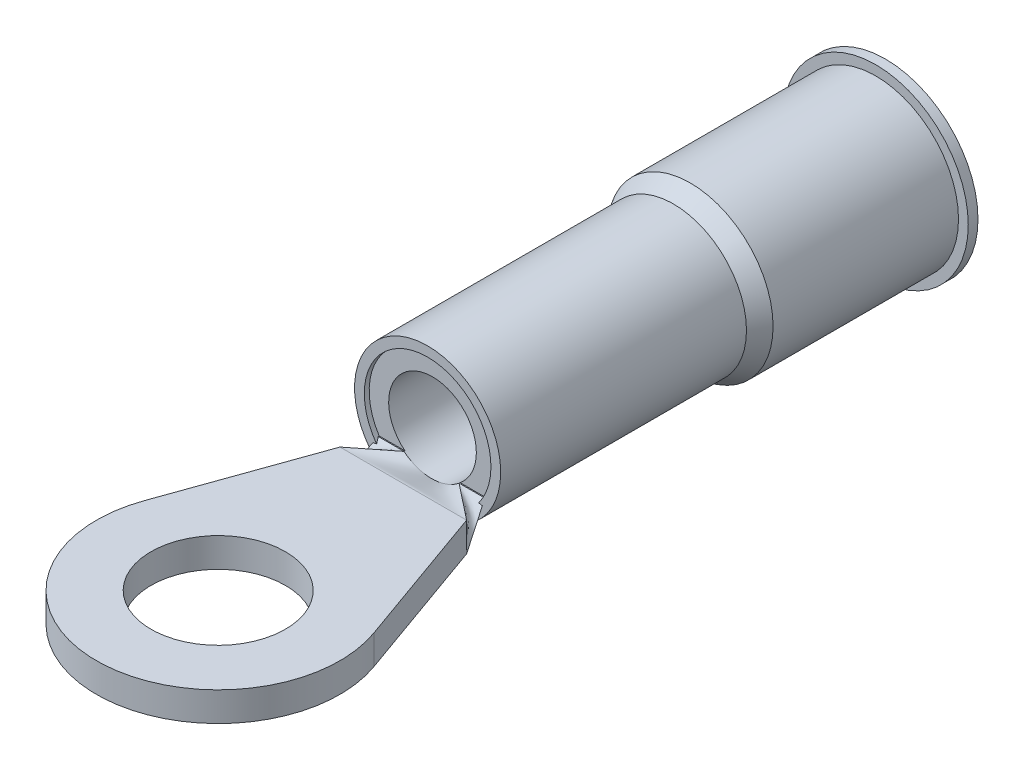
ISO-10303-21;
HEADER;
FILE_DESCRIPTION(('STEP AP214'),'2;1');
FILE_NAME('part.step','',(''),(''),'','','');
FILE_SCHEMA(('AUTOMOTIVE_DESIGN { 1 0 10303 214 1 1 1 1 }'));
ENDSEC;
DATA;
#1=APPLICATION_CONTEXT('core data for automotive mechanical design processes');
#2=APPLICATION_PROTOCOL_DEFINITION('international standard','automotive_design',2000,#1);
#3=PRODUCT_CONTEXT('',#1,'mechanical');
#4=PRODUCT('Part','Part','',(#3));
#5=PRODUCT_RELATED_PRODUCT_CATEGORY('part','',(#4));
#6=PRODUCT_DEFINITION_FORMATION('','',#4);
#7=PRODUCT_DEFINITION_CONTEXT('part definition',#1,'design');
#8=PRODUCT_DEFINITION('design','',#6,#7);
#9=PRODUCT_DEFINITION_SHAPE('','',#8);
#10=(LENGTH_UNIT() NAMED_UNIT(*) SI_UNIT(.MILLI.,.METRE.));
#11=(NAMED_UNIT(*) PLANE_ANGLE_UNIT() SI_UNIT($,.RADIAN.));
#12=(NAMED_UNIT(*) SI_UNIT($,.STERADIAN.) SOLID_ANGLE_UNIT());
#13=UNCERTAINTY_MEASURE_WITH_UNIT(LENGTH_MEASURE(1.E-05),#10,'distance_accuracy_value','');
#14=(GEOMETRIC_REPRESENTATION_CONTEXT(3) GLOBAL_UNCERTAINTY_ASSIGNED_CONTEXT((#13)) GLOBAL_UNIT_ASSIGNED_CONTEXT((#10,
#11,#12)) REPRESENTATION_CONTEXT('',''));
#15=CARTESIAN_POINT('',(0.,0.,0.));
#16=DIRECTION('',(0.,0.,1.));
#17=DIRECTION('',(1.,0.,0.));
#18=AXIS2_PLACEMENT_3D('',#15,#16,#17);
#19=CARTESIAN_POINT('',(-1.39121529606312,0.762,0.0254));
#20=CARTESIAN_POINT('',(-1.47781019737541,0.508,0.270933333333333));
#21=CARTESIAN_POINT('',(-1.56440509868771,0.254,0.516466666666667));
#22=CARTESIAN_POINT('',(-1.651,0.,0.762));
#23=CARTESIAN_POINT('',(-1.23955403655532,0.524662020194092,0.0254));
#24=CARTESIAN_POINT('',(-1.28498046881466,0.349774680129394,0.270933333333333));
#25=CARTESIAN_POINT('',(-1.330406901074,0.174887340064697,0.516466666666667));
#26=CARTESIAN_POINT('',(-1.37583333333333,0.,0.762));
#27=CARTESIAN_POINT('',(-0.83014051960649,0.143662020194092,0.0254));
#28=CARTESIAN_POINT('',(-0.82859367973766,0.0957746801293947,0.270933333333334));
#29=CARTESIAN_POINT('',(-0.82704683986883,0.0478873400646973,0.516466666666667));
#30=CARTESIAN_POINT('',(-0.8255,0.,0.762000000000001));
#31=CARTESIAN_POINT('',(0.,-0.0718310100970455,0.0254));
#32=CARTESIAN_POINT('',(0.,-0.047887340064697,0.270933333333333));
#33=CARTESIAN_POINT('',(0.,-0.0239436700323485,0.516466666666666));
#34=CARTESIAN_POINT('',(0.,0.,0.761999999999999));
#35=CARTESIAN_POINT('',(0.830140519606489,0.143662020194092,0.0254));
#36=CARTESIAN_POINT('',(0.828593679737659,0.0957746801293948,0.270933333333334));
#37=CARTESIAN_POINT('',(0.82704683986883,0.0478873400646974,0.516466666666667));
#38=CARTESIAN_POINT('',(0.8255,0.,0.762000000000001));
#39=CARTESIAN_POINT('',(1.23955403655532,0.524662020194091,0.0254));
#40=CARTESIAN_POINT('',(1.28498046881466,0.349774680129394,0.270933333333333));
#41=CARTESIAN_POINT('',(1.33040690107399,0.174887340064697,0.516466666666667));
#42=CARTESIAN_POINT('',(1.37583333333333,0.,0.762));
#43=CARTESIAN_POINT('',(1.39121529606312,0.761999999999999,0.0254));
#44=CARTESIAN_POINT('',(1.47781019737541,0.507999999999999,0.270933333333333));
#45=CARTESIAN_POINT('',(1.56440509868771,0.254,0.516466666666667));
#46=CARTESIAN_POINT('',(1.651,0.,0.762));
#47=B_SPLINE_SURFACE_WITH_KNOTS('',3,3,((#19,#20,#21,#22),(#23,#24,#25,#26),(#27,#28,#29,#30),
(#31,#32,#33,#34),(#35,#36,#37,#38),(#39,#40,#41,#42),(#43,#44,#45,#46)),.UNSPECIFIED.,.F.,.F.,
.F.,(4,1,1,1,4),(4,4),(0.,0.25,0.5,0.75,1.),(0.,1.),.UNSPECIFIED.);
#48=DIRECTION('',(0.238073071200388,0.698315480109153,-0.675038297438848));
#49=VECTOR('',#48,1.);
#50=CARTESIAN_POINT('',(-1.52110764803156,0.381,0.3937));
#51=LINE('',#50,#49);
#52=CARTESIAN_POINT('',(-1.651,0.,0.762));
#53=VERTEX_POINT('',#52);
#54=CARTESIAN_POINT('',(-1.42704766901993,0.656896551724138,0.127));
#55=VERTEX_POINT('',#54);
#56=EDGE_CURVE('E432',#53,#55,#51,.T.);
#57=CARTESIAN_POINT('',(-1.42704766901993,0.656896551724138,0.127));
#58=CARTESIAN_POINT('',(-1.39758191727476,0.621156019971046,0.127));
#59=CARTESIAN_POINT('',(-1.36669044147473,0.586618245457012,0.127));
#60=CARTESIAN_POINT('',(-1.30226329544282,0.520120364949861,0.127));
#61=CARTESIAN_POINT('',(-1.26872829772447,0.488159607520618,0.127));
#62=CARTESIAN_POINT('',(-1.16467924988584,0.396580652700039,0.127));
#63=CARTESIAN_POINT('',(-1.09052003773562,0.341023025084146,0.127));
#64=CARTESIAN_POINT('',(-0.929285470756384,0.238650935944051,0.127));
#65=CARTESIAN_POINT('',(-0.841675094746148,0.192685818214404,0.127));
#66=CARTESIAN_POINT('',(-0.66019061468465,0.115126560731954,0.127));
#67=CARTESIAN_POINT('',(-0.566309895673391,0.0835478816903494,0.127));
#68=CARTESIAN_POINT('',(-0.419844299965997,0.046371900769037,0.127));
#69=CARTESIAN_POINT('',(-0.368524098851723,0.0355340390327336,0.127));
#70=CARTESIAN_POINT('',(-0.265161649147126,0.0180561265052614,0.127));
#71=CARTESIAN_POINT('',(-0.213119427639096,0.0114159186968148,0.127));
#72=CARTESIAN_POINT('',(-0.108673566363522,0.00244437797419004,0.127));
#73=CARTESIAN_POINT('',(-0.0562699914721443,0.000112290822558793,0.127));
#74=CARTESIAN_POINT('',(0.0485457382792517,-0.000104238741521693,0.127));
#75=CARTESIAN_POINT('',(0.100957893091223,0.00201129473777937,0.127));
#76=CARTESIAN_POINT('',(0.206524326884028,0.0106467655091575,0.127));
#77=CARTESIAN_POINT('',(0.259671166651413,0.0172579957355603,0.127));
#78=CARTESIAN_POINT('',(0.36522394835596,0.0348561880133288,0.127));
#79=CARTESIAN_POINT('',(0.417629799086765,0.0458436839551839,0.127));
#80=CARTESIAN_POINT('',(0.573297522248406,0.0852546919277909,0.127));
#81=CARTESIAN_POINT('',(0.675022386288336,0.120127802259419,0.127));
#82=CARTESIAN_POINT('',(0.871986667874733,0.20731871631408,0.127));
#83=CARTESIAN_POINT('',(0.967144592048948,0.259820057509265,0.127));
#84=CARTESIAN_POINT('',(1.14626155002175,0.381128771582777,0.127));
#85=CARTESIAN_POINT('',(1.23024869613362,0.449893953605291,0.127));
#86=CARTESIAN_POINT('',(1.3281697677111,0.546529322523483,0.127));
#87=CARTESIAN_POINT('',(1.34874781009383,0.567905132476543,0.127));
#88=CARTESIAN_POINT('',(1.38875775940492,0.611655903662194,0.127));
#89=CARTESIAN_POINT('',(1.40819103259336,0.634029615454349,0.127));
#90=CARTESIAN_POINT('',(1.42704766901993,0.656896551724137,0.127));
#91=B_SPLINE_CURVE_WITH_KNOTS('',3,(#57,#58,#59,#60,#61,#62,#63,#64,#65,#66,#67,#68,#69,#70,#71,
#72,#73,#74,#75,#76,#77,#78,#79,#80,#81,#82,#83,#84,#85,#86,#87,#88,#89,#90),.UNSPECIFIED.,.F.,
.F.,(4,2,2,2,2,2,2,2,2,2,2,2,2,2,2,2,4),(0.,0.138884387927252,0.277733556910216,
0.554496905000208,0.850044656744678,1.14590928062392,1.30312528168604,1.46033540158456,
1.61751799555905,1.77469973753025,1.93517258639134,2.09566501842866,2.41661173840474,
2.74100934772726,3.06457447663388,3.15356286656676,3.24244280408155),.UNSPECIFIED.);
#92=CARTESIAN_POINT('',(1.42704766901993,0.656896551724138,0.127));
#93=VERTEX_POINT('',#92);
#94=EDGE_CURVE('E184',#55,#93,#91,.T.);
#95=DIRECTION('',(0.238073071200388,-0.698315480109153,0.675038297438848));
#96=VECTOR('',#95,1.);
#97=CARTESIAN_POINT('',(1.52110764803156,0.381,0.3937));
#98=LINE('',#97,#96);
#99=CARTESIAN_POINT('',(1.651,0.,0.762));
#100=VERTEX_POINT('',#99);
#101=EDGE_CURVE('E430',#93,#100,#98,.T.);
#102=DIRECTION('',(1.,0.,0.));
#103=VECTOR('',#102,1.);
#104=CARTESIAN_POINT('',(0.,0.,0.762));
#105=LINE('',#104,#103);
#106=EDGE_CURVE('E405',#100,#53,#105,.F.);
#107=ORIENTED_EDGE('',*,*,#56,.T.);
#108=ORIENTED_EDGE('',*,*,#94,.T.);
#109=ORIENTED_EDGE('',*,*,#101,.T.);
#110=ORIENTED_EDGE('',*,*,#106,.T.);
#111=EDGE_LOOP('',(#107,#108,#109,#110));
#112=FACE_BOUND('',#111,.T.);
#113=ADVANCED_FACE('F78',(#112),#47,.T.);
#114=CARTESIAN_POINT('',(-0.718420489685532,0.761999999999999,0.0254));
#115=CARTESIAN_POINT('',(-1.02928032645702,0.762,0.270933333333333));
#116=CARTESIAN_POINT('',(-1.34014016322851,0.762,0.516466666666667));
#117=CARTESIAN_POINT('',(-1.651,0.762,0.762));
#118=CARTESIAN_POINT('',(-0.774486723550331,0.761999999999999,0.0254));
#119=CARTESIAN_POINT('',(-1.06665781570022,0.740833333333333,0.270933333333333));
#120=CARTESIAN_POINT('',(-1.35882890785011,0.719666666666666,0.516466666666667));
#121=CARTESIAN_POINT('',(-1.651,0.6985,0.762));
#122=CARTESIAN_POINT('',(-0.88661919127993,0.761999999999999,0.0254));
#123=CARTESIAN_POINT('',(-1.14141279418662,0.6985,0.270933333333333));
#124=CARTESIAN_POINT('',(-1.39620639709331,0.635,0.516466666666666));
#125=CARTESIAN_POINT('',(-1.651,0.5715,0.762));
#126=CARTESIAN_POINT('',(-1.05481789287433,0.762,0.0254));
#127=CARTESIAN_POINT('',(-1.25354526191622,0.635,0.270933333333334));
#128=CARTESIAN_POINT('',(-1.45227263095811,0.508,0.516466666666668));
#129=CARTESIAN_POINT('',(-1.651,0.381,0.762000000000001));
#130=CARTESIAN_POINT('',(-1.22301659446872,0.761999999999999,0.0254));
#131=CARTESIAN_POINT('',(-1.36567772964582,0.5715,0.270933333333333));
#132=CARTESIAN_POINT('',(-1.50833886482291,0.381,0.516466666666666));
#133=CARTESIAN_POINT('',(-1.651,0.1905,0.761999999999999));
#134=CARTESIAN_POINT('',(-1.33514906219832,0.761999999999999,0.0254));
#135=CARTESIAN_POINT('',(-1.44043270813221,0.529166666666666,0.270933333333333));
#136=CARTESIAN_POINT('',(-1.54571635406611,0.296333333333333,0.516466666666667));
#137=CARTESIAN_POINT('',(-1.651,0.0635000000000003,0.762));
#138=CARTESIAN_POINT('',(-1.39121529606312,0.761999999999999,0.0254));
#139=CARTESIAN_POINT('',(-1.47781019737541,0.508,0.270933333333333));
#140=CARTESIAN_POINT('',(-1.56440509868771,0.254,0.516466666666667));
#141=CARTESIAN_POINT('',(-1.651,0.,0.762));
#142=B_SPLINE_SURFACE_WITH_KNOTS('',3,3,((#114,#115,#116,#117),(#118,#119,#120,#121),(#122,#123,
#124,#125),(#126,#127,#128,#129),(#130,#131,#132,#133),(#134,#135,#136,#137),(#138,#139,#140,
#141)),.UNSPECIFIED.,.F.,.F.,.F.,(4,1,1,1,4),(4,4),(0.809457468958157,0.857093101718618,
0.904728734479079,0.952364367239539,1.),(0.,1.),.UNSPECIFIED.);
#143=CARTESIAN_POINT('',(-1.39121529606312,0.762,0.0253999999999994));
#144=CARTESIAN_POINT('',(-1.38608855288108,0.753975647520577,0.0331610564142781));
#145=CARTESIAN_POINT('',(-1.38094789781283,0.746085406524645,0.0410563370567257));
#146=CARTESIAN_POINT('',(-1.3707085552637,0.730650018927489,0.0571622428158725));
#147=CARTESIAN_POINT('',(-1.36560980035942,0.723104151700813,0.0653721364053272));
#148=CARTESIAN_POINT('',(-1.3554998256097,0.708396876537606,0.0821896660357152));
#149=CARTESIAN_POINT('',(-1.35048862622041,0.701235557656195,0.0907973933569945));
#150=CARTESIAN_POINT('',(-1.34063818539088,0.687379878571269,0.108509285916107));
#151=CARTESIAN_POINT('',(-1.33579934700954,0.680686581615087,0.117614502831048));
#152=CARTESIAN_POINT('',(-1.33109964648684,0.674283699776335,0.126999999999995));
#153=B_SPLINE_CURVE_WITH_KNOTS('',3,(#143,#144,#145,#146,#147,#148,#149,#150,#151,#152),
.UNSPECIFIED.,.F.,.F.,(4,2,2,2,4),(0.,0.0368561073399838,0.0736311779630064,0.110414728684775,
0.147279297482322),.UNSPECIFIED.);
#154=CARTESIAN_POINT('',(-1.39121529606312,0.762,0.0254000000000001));
#155=VERTEX_POINT('',#154);
#156=CARTESIAN_POINT('',(-1.33109964648684,0.674283699776336,0.127));
#157=VERTEX_POINT('',#156);
#158=EDGE_CURVE('E174',#155,#157,#153,.T.);
#159=CARTESIAN_POINT('',(-0.847052146280631,0.761999999999999,0.127));
#160=CARTESIAN_POINT('',(-0.89873164530666,0.75263493882306,0.127));
#161=CARTESIAN_POINT('',(-0.950411144332689,0.74326987764612,0.127));
#162=CARTESIAN_POINT('',(-1.05377014238475,0.724539755292241,0.127));
#163=CARTESIAN_POINT('',(-1.10544964141078,0.715174694115301,0.127));
#164=CARTESIAN_POINT('',(-1.24710198329785,0.68950527253362,0.127));
#165=CARTESIAN_POINT('',(-1.33707482615889,0.673200912128879,0.127));
#166=CARTESIAN_POINT('',(-1.42704766901993,0.656896551724137,0.127));
#167=B_SPLINE_CURVE_WITH_KNOTS('',3,(#159,#160,#161,#162,#163,#164,#165,#166),.UNSPECIFIED.,.F.,
.F.,(4,2,2,4),(0.,0.157563558330797,0.315127116661593,0.589441719966538),.UNSPECIFIED.);
#168=EDGE_CURVE('E308',#157,#55,#167,.T.);
#169=DIRECTION('',(0.,1.,0.));
#170=VECTOR('',#169,1.);
#171=CARTESIAN_POINT('',(-1.651,0.762,0.762));
#172=LINE('',#171,#170);
#173=CARTESIAN_POINT('',(-1.651,0.762,0.761999999999999));
#174=VERTEX_POINT('',#173);
#175=EDGE_CURVE('E418',#174,#53,#172,.F.);
#176=DIRECTION('',(-0.784738272337792,0.,0.619827269429393));
#177=VECTOR('',#176,1.);
#178=CARTESIAN_POINT('',(-1.18471024484277,0.762,0.3937));
#179=LINE('',#178,#177);
#180=CARTESIAN_POINT('',(-0.718420489685532,0.762,0.0254));
#181=VERTEX_POINT('',#180);
#182=EDGE_CURVE('E204',#181,#174,#179,.T.);
#183=DIRECTION('',(-1.,0.,0.));
#184=VECTOR('',#183,1.);
#185=CARTESIAN_POINT('',(-0.718420489685532,0.761999999999999,0.0254));
#186=LINE('',#185,#184);
#187=EDGE_CURVE('E192',#181,#155,#186,.T.);
#188=ORIENTED_EDGE('',*,*,#158,.T.);
#189=ORIENTED_EDGE('',*,*,#168,.T.);
#190=ORIENTED_EDGE('',*,*,#56,.F.);
#191=ORIENTED_EDGE('',*,*,#175,.F.);
#192=ORIENTED_EDGE('',*,*,#182,.F.);
#193=ORIENTED_EDGE('',*,*,#187,.T.);
#194=EDGE_LOOP('',(#188,#189,#190,#191,#192,#193));
#195=FACE_BOUND('',#194,.T.);
#196=ADVANCED_FACE('F201',(#195),#142,.T.);
#197=CARTESIAN_POINT('',(0.718420489685532,0.761999999999999,0.0254));
#198=CARTESIAN_POINT('',(1.02928032645702,0.762,0.270933333333333));
#199=CARTESIAN_POINT('',(1.34014016322851,0.762,0.516466666666667));
#200=CARTESIAN_POINT('',(1.651,0.762,0.762));
#201=CARTESIAN_POINT('',(0.617715486250442,0.680618067624724,0.0254));
#202=CARTESIAN_POINT('',(0.870421435278072,0.707745378416483,0.270933333333333));
#203=CARTESIAN_POINT('',(1.1231273843057,0.734872689208241,0.516466666666667));
#204=CARTESIAN_POINT('',(1.37583333333333,0.762,0.762));
#205=CARTESIAN_POINT('',(0.388426025516563,0.552394071071588,0.0254000000000001));
#206=CARTESIAN_POINT('',(0.534117350344376,0.622262714047725,0.270933333333333));
#207=CARTESIAN_POINT('',(0.679808675172188,0.692131357023863,0.516466666666667));
#208=CARTESIAN_POINT('',(0.825500000000001,0.762,0.762));
#209=CARTESIAN_POINT('',(0.,0.485773897218784,0.0254));
#210=CARTESIAN_POINT('',(0.,0.577849264812523,0.270933333333333));
#211=CARTESIAN_POINT('',(0.,0.669924632406261,0.516466666666667));
#212=CARTESIAN_POINT('',(0.,0.762,0.762));
#213=CARTESIAN_POINT('',(-0.388426025516564,0.552394071071588,0.0254));
#214=CARTESIAN_POINT('',(-0.534117350344376,0.622262714047725,0.270933333333333));
#215=CARTESIAN_POINT('',(-0.679808675172188,0.692131357023863,0.516466666666667));
#216=CARTESIAN_POINT('',(-0.8255,0.762,0.762));
#217=CARTESIAN_POINT('',(-0.617715486250443,0.680618067624724,0.0254));
#218=CARTESIAN_POINT('',(-0.870421435278073,0.707745378416483,0.270933333333333));
#219=CARTESIAN_POINT('',(-1.1231273843057,0.734872689208241,0.516466666666667));
#220=CARTESIAN_POINT('',(-1.37583333333333,0.762,0.762));
#221=CARTESIAN_POINT('',(-0.718420489685532,0.761999999999999,0.0254));
#222=CARTESIAN_POINT('',(-1.02928032645702,0.762,0.270933333333333));
#223=CARTESIAN_POINT('',(-1.34014016322851,0.762,0.516466666666667));
#224=CARTESIAN_POINT('',(-1.651,0.762,0.762));
#225=B_SPLINE_SURFACE_WITH_KNOTS('',3,3,((#197,#198,#199,#200),(#201,#202,#203,#204),(#205,#206,
#207,#208),(#209,#210,#211,#212),(#213,#214,#215,#216),(#217,#218,#219,#220),(#221,#222,#223,
#224)),.UNSPECIFIED.,.F.,.F.,.F.,(4,1,1,1,4),(4,4),(0.190542531041843,0.345271265520921,0.5,
0.654728734479079,0.809457468958157),(0.,1.),.UNSPECIFIED.);
#226=CARTESIAN_POINT('',(0.,1.651,0.0254));
#227=DIRECTION('',(0.,0.,-1.));
#228=DIRECTION('',(1.,0.,0.));
#229=AXIS2_PLACEMENT_3D('',#226,#227,#228);
#230=CIRCLE('',#229,1.143);
#231=CARTESIAN_POINT('',(0.718420489685532,0.761999999999999,0.0254));
#232=VERTEX_POINT('',#231);
#233=CARTESIAN_POINT('',(0.280093594641271,0.542819573389863,0.0254));
#234=VERTEX_POINT('',#233);
#235=EDGE_CURVE('E206',#232,#234,#230,.T.);
#236=CARTESIAN_POINT('',(0.280086317799953,0.542848090476192,0.0254));
#237=CARTESIAN_POINT('',(0.274435453146551,0.541419829924682,0.0253898757300014));
#238=CARTESIAN_POINT('',(0.268773634953075,0.540034876181237,0.0253815517042047));
#239=CARTESIAN_POINT('',(0.256810333648759,0.537205395040891,0.025367029172351));
#240=CARTESIAN_POINT('',(0.250506484126485,0.535770865005437,0.0253611618348143));
#241=CARTESIAN_POINT('',(0.237253661374286,0.532873047210581,0.0253515275315568));
#242=CARTESIAN_POINT('',(0.23030226611733,0.531420828445981,0.0253480241666326));
#243=CARTESIAN_POINT('',(0.215749315169803,0.528521761640067,0.0253431953071069));
#244=CARTESIAN_POINT('',(0.208145337102078,0.527087064644947,0.0253420931933865));
#245=CARTESIAN_POINT('',(0.192282898443226,0.52426052919858,0.0253420952879215));
#246=CARTESIAN_POINT('',(0.184022076020688,0.522881934751302,0.0253433885339403));
#247=CARTESIAN_POINT('',(0.166842658096937,0.520208501393833,0.0253482149334854));
#248=CARTESIAN_POINT('',(0.157921827716278,0.518928010945526,0.0253519109914221));
#249=CARTESIAN_POINT('',(0.139420476007071,0.516495147330165,0.025361559850228));
#250=CARTESIAN_POINT('',(0.129837918764648,0.515358239536721,0.0253676537671633));
#251=CARTESIAN_POINT('',(0.110012945822629,0.513260419584125,0.025382142066703));
#252=CARTESIAN_POINT('',(0.0997687718967419,0.512316102862729,0.0253906618603731));
#253=CARTESIAN_POINT('',(0.0895136704791261,0.511510507816197,0.0254));
#254=B_SPLINE_CURVE_WITH_KNOTS('',3,(#236,#237,#238,#239,#240,#241,#242,#243,#244,#245,#246,
#247,#248,#249,#250,#251,#252,#253),.UNSPECIFIED.,.F.,.F.,(4,2,2,2,2,2,2,2,4),(0.,
0.0174855734570703,0.0368796879760257,0.0581828587489586,0.0813956904950005,0.10651886566124,
0.133553138647615,0.162499343526083,0.193358425668611),.UNSPECIFIED.);
#255=CARTESIAN_POINT('',(0.089516606997273,0.511472074409526,0.0254));
#256=VERTEX_POINT('',#255);
#257=EDGE_CURVE('E13',#234,#256,#254,.T.);
#258=CARTESIAN_POINT('',(0.718420489685532,0.761999999999999,0.0254));
#259=CARTESIAN_POINT('',(0.617715486250442,0.680618067624724,0.0254));
#260=CARTESIAN_POINT('',(0.388426025516563,0.552394071071588,0.0254000000000001));
#261=CARTESIAN_POINT('',(0.,0.485773897218784,0.0254));
#262=CARTESIAN_POINT('',(-0.388426025516564,0.552394071071588,0.0254));
#263=CARTESIAN_POINT('',(-0.617715486250443,0.680618067624724,0.0254));
#264=CARTESIAN_POINT('',(-0.718420489685532,0.761999999999999,0.0254));
#265=B_SPLINE_CURVE_WITH_KNOTS('',3,(#258,#259,#260,#261,#262,#263,#264),.UNSPECIFIED.,.F.,.F.,
(4,1,1,1,4),(0.190542531041843,0.345271265520921,0.5,0.654728734479079,0.809457468958157),.UNSPECIFIED.);
#266=CARTESIAN_POINT('',(-0.0895153171618941,0.51148892797954,0.0254));
#267=VERTEX_POINT('',#266);
#268=EDGE_CURVE('E197',#256,#267,#265,.T.);
#269=CARTESIAN_POINT('',(-0.0895136706448394,0.511510507829265,0.0254));
#270=CARTESIAN_POINT('',(-0.0997687720410653,0.512316102875615,0.0253906618603894));
#271=CARTESIAN_POINT('',(-0.110012945945588,0.513260419596252,0.0253821420667349));
#272=CARTESIAN_POINT('',(-0.1298379188475,0.515358239546391,0.0253676537672216));
#273=CARTESIAN_POINT('',(-0.139420476071171,0.516495147338236,0.0253615598502975));
#274=CARTESIAN_POINT('',(-0.157921827745502,0.518928010949762,0.025351910991509));
#275=CARTESIAN_POINT('',(-0.166842658110025,0.520208501395922,0.0253482149335793));
#276=CARTESIAN_POINT('',(-0.184022076004126,0.52288193474873,0.0253433885340428));
#277=CARTESIAN_POINT('',(-0.192282898413135,0.524260529193574,0.0253420952880267));
#278=CARTESIAN_POINT('',(-0.208145337047529,0.527087064634951,0.0253420931934917));
#279=CARTESIAN_POINT('',(-0.215749315104312,0.528521761627587,0.0253431953072103));
#280=CARTESIAN_POINT('',(-0.230302266032525,0.531420828428625,0.0253480241667272));
#281=CARTESIAN_POINT('',(-0.237253661281096,0.532873047190899,0.0253515275316453));
#282=CARTESIAN_POINT('',(-0.250506484019064,0.535770864981382,0.0253611618348855));
#283=CARTESIAN_POINT('',(-0.256810333535479,0.537205395014848,0.0253670291724122));
#284=CARTESIAN_POINT('',(-0.268773634830581,0.540034876151665,0.0253815517042392));
#285=CARTESIAN_POINT('',(-0.27443545302069,0.541419829893615,0.0253898757300211));
#286=CARTESIAN_POINT('',(-0.280086317670744,0.542848090443578,0.0254));
#287=B_SPLINE_CURVE_WITH_KNOTS('',3,(#269,#270,#271,#272,#273,#274,#275,#276,#277,#278,#279,
#280,#281,#282,#283,#284,#285,#286),.UNSPECIFIED.,.F.,.F.,(4,2,2,2,2,2,2,2,4),(0.,
0.0308590820785189,0.0598052869005761,0.0868395598381356,0.111962734963151,0.135175566675559,
0.156478737422446,0.175872851922941,0.193358425369136),.UNSPECIFIED.);
#288=CARTESIAN_POINT('',(-0.280097541124282,0.542804046174763,0.0254));
#289=VERTEX_POINT('',#288);
#290=EDGE_CURVE('E89',#267,#289,#287,.T.);
#291=CARTESIAN_POINT('',(0.718420489685532,0.761999999999999,0.0254));
#292=CARTESIAN_POINT('',(0.617715486250442,0.680618067624724,0.0254));
#293=CARTESIAN_POINT('',(0.388426025516563,0.552394071071588,0.0254000000000001));
#294=CARTESIAN_POINT('',(0.,0.485773897218784,0.0254));
#295=CARTESIAN_POINT('',(-0.388426025516564,0.552394071071588,0.0254));
#296=CARTESIAN_POINT('',(-0.617715486250443,0.680618067624724,0.0254));
#297=CARTESIAN_POINT('',(-0.718420489685532,0.761999999999999,0.0254));
#298=B_SPLINE_CURVE_WITH_KNOTS('',3,(#291,#292,#293,#294,#295,#296,#297),.UNSPECIFIED.,.F.,.F.,
(4,1,1,1,4),(0.190542531041843,0.345271265520921,0.5,0.654728734479079,0.809457468958157),.UNSPECIFIED.);
#299=EDGE_CURVE('E332',#289,#181,#298,.T.);
#300=DIRECTION('',(1.,0.,0.));
#301=VECTOR('',#300,1.);
#302=CARTESIAN_POINT('',(0.,0.762,0.762));
#303=LINE('',#302,#301);
#304=CARTESIAN_POINT('',(1.651,0.762,0.762));
#305=VERTEX_POINT('',#304);
#306=EDGE_CURVE('E421',#305,#174,#303,.F.);
#307=DIRECTION('',(0.784738272337792,0.,0.619827269429393));
#308=VECTOR('',#307,1.);
#309=CARTESIAN_POINT('',(1.18471024484277,0.762,0.3937));
#310=LINE('',#309,#308);
#311=EDGE_CURVE('E300',#232,#305,#310,.T.);
#312=ORIENTED_EDGE('',*,*,#235,.T.);
#313=ORIENTED_EDGE('',*,*,#257,.T.);
#314=ORIENTED_EDGE('',*,*,#268,.T.);
#315=ORIENTED_EDGE('',*,*,#290,.T.);
#316=ORIENTED_EDGE('',*,*,#299,.T.);
#317=ORIENTED_EDGE('',*,*,#182,.T.);
#318=ORIENTED_EDGE('',*,*,#306,.F.);
#319=ORIENTED_EDGE('',*,*,#311,.F.);
#320=EDGE_LOOP('',(#312,#313,#314,#315,#316,#317,#318,#319));
#321=FACE_BOUND('',#320,.T.);
#322=ADVANCED_FACE('F230',(#321),#225,.T.);
#323=CARTESIAN_POINT('',(1.39121529606312,0.761999999999999,0.0254));
#324=CARTESIAN_POINT('',(1.47781019737541,0.508,0.270933333333333));
#325=CARTESIAN_POINT('',(1.56440509868771,0.254,0.516466666666667));
#326=CARTESIAN_POINT('',(1.651,0.,0.762));
#327=CARTESIAN_POINT('',(1.33514906219832,0.761999999999999,0.0254));
#328=CARTESIAN_POINT('',(1.44043270813221,0.529166666666666,0.270933333333333));
#329=CARTESIAN_POINT('',(1.54571635406611,0.296333333333333,0.516466666666667));
#330=CARTESIAN_POINT('',(1.651,0.0635000000000002,0.762));
#331=CARTESIAN_POINT('',(1.22301659446872,0.761999999999999,0.0254));
#332=CARTESIAN_POINT('',(1.36567772964582,0.571499999999999,0.270933333333333));
#333=CARTESIAN_POINT('',(1.50833886482291,0.381,0.516466666666667));
#334=CARTESIAN_POINT('',(1.651,0.1905,0.762));
#335=CARTESIAN_POINT('',(1.05481789287433,0.762000000000001,0.0254));
#336=CARTESIAN_POINT('',(1.25354526191622,0.635,0.270933333333334));
#337=CARTESIAN_POINT('',(1.45227263095811,0.508000000000001,0.516466666666667));
#338=CARTESIAN_POINT('',(1.651,0.381000000000001,0.762000000000001));
#339=CARTESIAN_POINT('',(0.886619191279928,0.761999999999998,0.0254));
#340=CARTESIAN_POINT('',(1.14141279418662,0.698499999999999,0.270933333333333));
#341=CARTESIAN_POINT('',(1.39620639709331,0.634999999999999,0.516466666666666));
#342=CARTESIAN_POINT('',(1.651,0.5715,0.761999999999999));
#343=CARTESIAN_POINT('',(0.774486723550331,0.761999999999999,0.0254));
#344=CARTESIAN_POINT('',(1.06665781570022,0.740833333333333,0.270933333333333));
#345=CARTESIAN_POINT('',(1.35882890785011,0.719666666666667,0.516466666666667));
#346=CARTESIAN_POINT('',(1.651,0.6985,0.762));
#347=CARTESIAN_POINT('',(0.718420489685532,0.761999999999999,0.0254));
#348=CARTESIAN_POINT('',(1.02928032645702,0.762,0.270933333333333));
#349=CARTESIAN_POINT('',(1.34014016322851,0.762,0.516466666666667));
#350=CARTESIAN_POINT('',(1.651,0.762,0.762));
#351=B_SPLINE_SURFACE_WITH_KNOTS('',3,3,((#323,#324,#325,#326),(#327,#328,#329,#330),(#331,#332,
#333,#334),(#335,#336,#337,#338),(#339,#340,#341,#342),(#343,#344,#345,#346),(#347,#348,#349,
#350)),.UNSPECIFIED.,.F.,.F.,.F.,(4,1,1,1,4),(4,4),(0.,0.0476356327604607,0.0952712655209215,
0.142906898281382,0.190542531041843),(0.,1.),.UNSPECIFIED.);
#352=CARTESIAN_POINT('',(1.42704766901993,0.656896551724138,0.127));
#353=CARTESIAN_POINT('',(1.3753681699939,0.666261612901078,0.127));
#354=CARTESIAN_POINT('',(1.32368867096786,0.675626674078019,0.127));
#355=CARTESIAN_POINT('',(1.22032967291579,0.6943567964319,0.127));
#356=CARTESIAN_POINT('',(1.16865017388976,0.703721857608841,0.127));
#357=CARTESIAN_POINT('',(1.02699783200269,0.729391279190522,0.127));
#358=CARTESIAN_POINT('',(0.937024989141662,0.745695639595261,0.127));
#359=CARTESIAN_POINT('',(0.847052146280631,0.762,0.127));
#360=B_SPLINE_CURVE_WITH_KNOTS('',3,(#352,#353,#354,#355,#356,#357,#358,#359),.UNSPECIFIED.,.F.,
.F.,(4,2,2,4),(0.,0.157563558330814,0.315127116661628,0.58944171996654),.UNSPECIFIED.);
#361=CARTESIAN_POINT('',(1.33109964649123,0.674283699782314,0.127));
#362=VERTEX_POINT('',#361);
#363=EDGE_CURVE('E269',#93,#362,#360,.T.);
#364=CARTESIAN_POINT('',(1.33109964649391,0.674283699780344,0.12699999999676));
#365=CARTESIAN_POINT('',(1.33579934701372,0.680686581618788,0.117614502826859));
#366=CARTESIAN_POINT('',(1.34063818539373,0.68737987857469,0.108509285911823));
#367=CARTESIAN_POINT('',(1.35048862622201,0.701235557659042,0.0907973933532686));
#368=CARTESIAN_POINT('',(1.35549982561136,0.708396876540158,0.0821896660326391));
#369=CARTESIAN_POINT('',(1.36560980036082,0.723104151702711,0.0653721364033144));
#370=CARTESIAN_POINT('',(1.37070855526479,0.730650018929025,0.057162242814273));
#371=CARTESIAN_POINT('',(1.38094789781329,0.746085406525429,0.041056337055906));
#372=CARTESIAN_POINT('',(1.38608855288121,0.753975647520971,0.0331610564138253));
#373=CARTESIAN_POINT('',(1.39121529606312,0.761999999999999,0.0254));
#374=B_SPLINE_CURVE_WITH_KNOTS('',3,(#364,#365,#366,#367,#368,#369,#370,#371,#372,#373),
.UNSPECIFIED.,.F.,.F.,(4,2,2,2,4),(0.,0.0368645687957489,0.0736481195156765,0.110423190136819,
0.147279297474967),.UNSPECIFIED.);
#375=CARTESIAN_POINT('',(1.39121529606312,0.761999999999999,0.0254));
#376=VERTEX_POINT('',#375);
#377=EDGE_CURVE('E267',#362,#376,#374,.T.);
#378=DIRECTION('',(-1.,0.,0.));
#379=VECTOR('',#378,1.);
#380=CARTESIAN_POINT('',(1.39121529606312,0.761999999999999,0.0254));
#381=LINE('',#380,#379);
#382=EDGE_CURVE('E82',#376,#232,#381,.T.);
#383=DIRECTION('',(0.,1.,0.));
#384=VECTOR('',#383,1.);
#385=CARTESIAN_POINT('',(1.651,0.762,0.762));
#386=LINE('',#385,#384);
#387=EDGE_CURVE('E416',#305,#100,#386,.F.);
#388=ORIENTED_EDGE('',*,*,#101,.F.);
#389=ORIENTED_EDGE('',*,*,#363,.T.);
#390=ORIENTED_EDGE('',*,*,#377,.T.);
#391=ORIENTED_EDGE('',*,*,#382,.T.);
#392=ORIENTED_EDGE('',*,*,#311,.T.);
#393=ORIENTED_EDGE('',*,*,#387,.T.);
#394=EDGE_LOOP('',(#388,#389,#390,#391,#392,#393));
#395=FACE_BOUND('',#394,.T.);
#396=ADVANCED_FACE('F274',(#395),#351,.T.);
#397=CARTESIAN_POINT('',(0.,0.762,5.588));
#398=DIRECTION('',(0.,1.,0.));
#399=DIRECTION('',(0.,0.,1.));
#400=AXIS2_PLACEMENT_3D('',#397,#398,#399);
#401=PLANE('',#400);
#402=ORIENTED_EDGE('',*,*,#306,.T.);
#403=DIRECTION('',(-0.335634175583977,0.,0.941992409831451));
#404=VECTOR('',#403,1.);
#405=CARTESIAN_POINT('',(-1.651,0.762,0.762));
#406=LINE('',#405,#404);
#407=CARTESIAN_POINT('',(-2.99082590121486,0.762,4.52236149252087));
#408=VERTEX_POINT('',#407);
#409=EDGE_CURVE('E111',#174,#408,#406,.T.);
#410=ORIENTED_EDGE('',*,*,#409,.T.);
#411=CARTESIAN_POINT('',(0.,0.762,5.588));
#412=DIRECTION('',(0.,1.,0.));
#413=DIRECTION('',(0.,0.,1.));
#414=AXIS2_PLACEMENT_3D('',#411,#412,#413);
#415=CIRCLE('',#414,3.175);
#416=CARTESIAN_POINT('',(2.99082590121486,0.762,4.52236149252087));
#417=VERTEX_POINT('',#416);
#418=EDGE_CURVE('E408',#408,#417,#415,.T.);
#419=ORIENTED_EDGE('',*,*,#418,.T.);
#420=DIRECTION('',(-0.335634175583977,0.,-0.941992409831451));
#421=VECTOR('',#420,1.);
#422=CARTESIAN_POINT('',(1.651,0.762,0.762));
#423=LINE('',#422,#421);
#424=EDGE_CURVE('E97',#417,#305,#423,.T.);
#425=ORIENTED_EDGE('',*,*,#424,.T.);
#426=EDGE_LOOP('',(#402,#410,#419,#425));
#427=FACE_BOUND('',#426,.T.);
#428=CARTESIAN_POINT('',(0.,0.762,5.588));
#429=DIRECTION('',(0.,1.,0.));
#430=DIRECTION('',(0.,0.,1.));
#431=AXIS2_PLACEMENT_3D('',#428,#429,#430);
#432=CIRCLE('',#431,1.7526);
#433=CARTESIAN_POINT('',(0.,0.762,3.8354));
#434=VERTEX_POINT('',#433);
#435=EDGE_CURVE('E402',#434,#434,#432,.T.);
#436=ORIENTED_EDGE('',*,*,#435,.F.);
#437=EDGE_LOOP('',(#436));
#438=FACE_BOUND('',#437,.T.);
#439=ADVANCED_FACE('F280',(#427,#438),#401,.T.);
#440=CARTESIAN_POINT('',(0.,0.,5.588));
#441=DIRECTION('',(0.,1.,0.));
#442=DIRECTION('',(0.,0.,1.));
#443=AXIS2_PLACEMENT_3D('',#440,#441,#442);
#444=PLANE('',#443);
#445=ORIENTED_EDGE('',*,*,#106,.F.);
#446=DIRECTION('',(-0.335634175583977,0.,-0.941992409831451));
#447=VECTOR('',#446,1.);
#448=CARTESIAN_POINT('',(1.651,0.,0.762));
#449=LINE('',#448,#447);
#450=CARTESIAN_POINT('',(2.99082590121486,0.,4.52236149252087));
#451=VERTEX_POINT('',#450);
#452=EDGE_CURVE('E411',#451,#100,#449,.T.);
#453=ORIENTED_EDGE('',*,*,#452,.F.);
#454=CARTESIAN_POINT('',(0.,0.,5.588));
#455=DIRECTION('',(0.,1.,0.));
#456=DIRECTION('',(0.,0.,1.));
#457=AXIS2_PLACEMENT_3D('',#454,#455,#456);
#458=CIRCLE('',#457,3.175);
#459=CARTESIAN_POINT('',(-2.99082590121486,0.,4.52236149252087));
#460=VERTEX_POINT('',#459);
#461=EDGE_CURVE('E119',#460,#451,#458,.T.);
#462=ORIENTED_EDGE('',*,*,#461,.F.);
#463=DIRECTION('',(-0.335634175583977,0.,0.941992409831451));
#464=VECTOR('',#463,1.);
#465=CARTESIAN_POINT('',(-1.651,0.,0.762));
#466=LINE('',#465,#464);
#467=EDGE_CURVE('E412',#53,#460,#466,.T.);
#468=ORIENTED_EDGE('',*,*,#467,.F.);
#469=EDGE_LOOP('',(#445,#453,#462,#468));
#470=FACE_BOUND('',#469,.T.);
#471=CARTESIAN_POINT('',(0.,0.,5.588));
#472=DIRECTION('',(0.,1.,0.));
#473=DIRECTION('',(0.,0.,1.));
#474=AXIS2_PLACEMENT_3D('',#471,#472,#473);
#475=CIRCLE('',#474,1.7526);
#476=CARTESIAN_POINT('',(0.,0.,3.8354));
#477=VERTEX_POINT('',#476);
#478=EDGE_CURVE('E205',#477,#477,#475,.T.);
#479=ORIENTED_EDGE('',*,*,#478,.T.);
#480=EDGE_LOOP('',(#479));
#481=FACE_BOUND('',#480,.T.);
#482=ADVANCED_FACE('F577',(#470,#481),#444,.F.);
#483=CARTESIAN_POINT('',(-1.651,0.762,0.762));
#484=DIRECTION('',(0.941992409831451,0.,0.335634175583977));
#485=DIRECTION('',(0.335634175583977,0.,-0.941992409831451));
#486=AXIS2_PLACEMENT_3D('',#483,#484,#485);
#487=PLANE('',#486);
#488=ORIENTED_EDGE('',*,*,#467,.T.);
#489=DIRECTION('',(0.,-1.,0.));
#490=VECTOR('',#489,1.);
#491=CARTESIAN_POINT('',(-2.99082590121486,0.762,4.52236149252087));
#492=LINE('',#491,#490);
#493=EDGE_CURVE('E415',#408,#460,#492,.T.);
#494=ORIENTED_EDGE('',*,*,#493,.F.);
#495=ORIENTED_EDGE('',*,*,#409,.F.);
#496=ORIENTED_EDGE('',*,*,#175,.T.);
#497=EDGE_LOOP('',(#488,#494,#495,#496));
#498=FACE_BOUND('',#497,.T.);
#499=ADVANCED_FACE('F80',(#498),#487,.F.);
#500=CARTESIAN_POINT('',(0.,0.762,5.588));
#501=DIRECTION('',(0.,-1.,0.));
#502=DIRECTION('',(0.,0.,-1.));
#503=AXIS2_PLACEMENT_3D('',#500,#501,#502);
#504=CYLINDRICAL_SURFACE('',#503,3.175);
#505=ORIENTED_EDGE('',*,*,#461,.T.);
#506=DIRECTION('',(0.,-1.,0.));
#507=VECTOR('',#506,1.);
#508=CARTESIAN_POINT('',(2.99082590121486,0.762,4.52236149252087));
#509=LINE('',#508,#507);
#510=EDGE_CURVE('E413',#417,#451,#509,.T.);
#511=ORIENTED_EDGE('',*,*,#510,.F.);
#512=ORIENTED_EDGE('',*,*,#418,.F.);
#513=ORIENTED_EDGE('',*,*,#493,.T.);
#514=EDGE_LOOP('',(#505,#511,#512,#513));
#515=FACE_BOUND('',#514,.T.);
#516=ADVANCED_FACE('F590',(#515),#504,.T.);
#517=CARTESIAN_POINT('',(1.651,0.762,0.762));
#518=DIRECTION('',(-0.941992409831451,0.,0.335634175583977));
#519=DIRECTION('',(0.335634175583977,0.,0.941992409831451));
#520=AXIS2_PLACEMENT_3D('',#517,#518,#519);
#521=PLANE('',#520);
#522=ORIENTED_EDGE('',*,*,#452,.T.);
#523=ORIENTED_EDGE('',*,*,#387,.F.);
#524=ORIENTED_EDGE('',*,*,#424,.F.);
#525=ORIENTED_EDGE('',*,*,#510,.T.);
#526=EDGE_LOOP('',(#522,#523,#524,#525));
#527=FACE_BOUND('',#526,.T.);
#528=ADVANCED_FACE('F597',(#527),#521,.F.);
#529=CARTESIAN_POINT('',(0.,0.762,5.588));
#530=DIRECTION('',(0.,-1.,0.));
#531=DIRECTION('',(0.,0.,-1.));
#532=AXIS2_PLACEMENT_3D('',#529,#530,#531);
#533=CYLINDRICAL_SURFACE('',#532,1.7526);
#534=CARTESIAN_POINT('',(0.,0.762,3.8354));
#535=CARTESIAN_POINT('',(0.,0.7540625,3.8354));
#536=CARTESIAN_POINT('',(0.,0.746125,3.8354));
#537=CARTESIAN_POINT('',(0.,0.73025,3.8354));
#538=CARTESIAN_POINT('',(0.,0.7223125,3.8354));
#539=CARTESIAN_POINT('',(0.,0.7064375,3.8354));
#540=CARTESIAN_POINT('',(0.,0.6985,3.8354));
#541=CARTESIAN_POINT('',(0.,0.682625,3.8354));
#542=CARTESIAN_POINT('',(0.,0.6746875,3.8354));
#543=CARTESIAN_POINT('',(0.,0.6588125,3.8354));
#544=CARTESIAN_POINT('',(0.,0.650875,3.8354));
#545=CARTESIAN_POINT('',(0.,0.635,3.8354));
#546=CARTESIAN_POINT('',(0.,0.6270625,3.8354));
#547=CARTESIAN_POINT('',(0.,0.6111875,3.8354));
#548=CARTESIAN_POINT('',(0.,0.60325,3.8354));
#549=CARTESIAN_POINT('',(0.,0.587375,3.8354));
#550=CARTESIAN_POINT('',(0.,0.5794375,3.8354));
#551=CARTESIAN_POINT('',(0.,0.5635625,3.8354));
#552=CARTESIAN_POINT('',(0.,0.555625,3.8354));
#553=CARTESIAN_POINT('',(0.,0.53975,3.8354));
#554=CARTESIAN_POINT('',(0.,0.5318125,3.8354));
#555=CARTESIAN_POINT('',(0.,0.5159375,3.8354));
#556=CARTESIAN_POINT('',(0.,0.508,3.8354));
#557=CARTESIAN_POINT('',(0.,0.492125,3.8354));
#558=CARTESIAN_POINT('',(0.,0.4841875,3.8354));
#559=CARTESIAN_POINT('',(0.,0.4683125,3.8354));
#560=CARTESIAN_POINT('',(0.,0.460375,3.8354));
#561=CARTESIAN_POINT('',(0.,0.4445,3.8354));
#562=CARTESIAN_POINT('',(0.,0.4365625,3.8354));
#563=CARTESIAN_POINT('',(0.,0.4206875,3.8354));
#564=CARTESIAN_POINT('',(0.,0.41275,3.8354));
#565=CARTESIAN_POINT('',(0.,0.396875,3.8354));
#566=CARTESIAN_POINT('',(0.,0.3889375,3.8354));
#567=CARTESIAN_POINT('',(0.,0.3730625,3.8354));
#568=CARTESIAN_POINT('',(0.,0.365125,3.8354));
#569=CARTESIAN_POINT('',(0.,0.34925,3.8354));
#570=CARTESIAN_POINT('',(0.,0.3413125,3.8354));
#571=CARTESIAN_POINT('',(0.,0.3254375,3.8354));
#572=CARTESIAN_POINT('',(0.,0.3175,3.8354));
#573=CARTESIAN_POINT('',(0.,0.301625,3.8354));
#574=CARTESIAN_POINT('',(0.,0.2936875,3.8354));
#575=CARTESIAN_POINT('',(0.,0.2778125,3.8354));
#576=CARTESIAN_POINT('',(0.,0.269875,3.8354));
#577=CARTESIAN_POINT('',(0.,0.254,3.8354));
#578=CARTESIAN_POINT('',(0.,0.2460625,3.8354));
#579=CARTESIAN_POINT('',(0.,0.2301875,3.8354));
#580=CARTESIAN_POINT('',(0.,0.22225,3.8354));
#581=CARTESIAN_POINT('',(0.,0.206375,3.8354));
#582=CARTESIAN_POINT('',(0.,0.1984375,3.8354));
#583=CARTESIAN_POINT('',(0.,0.1825625,3.8354));
#584=CARTESIAN_POINT('',(0.,0.174625,3.8354));
#585=CARTESIAN_POINT('',(0.,0.15875,3.8354));
#586=CARTESIAN_POINT('',(0.,0.1508125,3.8354));
#587=CARTESIAN_POINT('',(0.,0.1349375,3.8354));
#588=CARTESIAN_POINT('',(0.,0.127,3.8354));
#589=CARTESIAN_POINT('',(0.,0.111125,3.8354));
#590=CARTESIAN_POINT('',(0.,0.1031875,3.8354));
#591=CARTESIAN_POINT('',(0.,0.0873125,3.8354));
#592=CARTESIAN_POINT('',(0.,0.079375,3.8354));
#593=CARTESIAN_POINT('',(0.,0.0635,3.8354));
#594=CARTESIAN_POINT('',(0.,0.0555625,3.8354));
#595=CARTESIAN_POINT('',(0.,0.0396875,3.8354));
#596=CARTESIAN_POINT('',(0.,0.03175,3.8354));
#597=CARTESIAN_POINT('',(0.,0.015875,3.8354));
#598=CARTESIAN_POINT('',(0.,0.00793749999999999,3.8354));
#599=CARTESIAN_POINT('',(0.,0.,3.8354));
#600=B_SPLINE_CURVE_WITH_KNOTS('',3,(#534,#535,#536,#537,#538,#539,#540,#541,#542,#543,#544,
#545,#546,#547,#548,#549,#550,#551,#552,#553,#554,#555,#556,#557,#558,#559,#560,#561,#562,#563,
#564,#565,#566,#567,#568,#569,#570,#571,#572,#573,#574,#575,#576,#577,#578,#579,#580,#581,#582,
#583,#584,#585,#586,#587,#588,#589,#590,#591,#592,#593,#594,#595,#596,#597,#598,#599),
.UNSPECIFIED.,.F.,.F.,(4,2,2,2,2,2,2,2,2,2,2,2,2,2,2,2,2,2,2,2,2,2,2,2,2,2,2,2,2,2,2,2,4),(0.,
0.0238125,0.0476249999999999,0.0714374999999999,0.09525,0.1190625,0.142875,0.1666875,0.1905,
0.2143125,0.238125,0.2619375,0.28575,0.3095625,0.333375,0.3571875,0.381,0.4048125,0.428625,
0.4524375,0.47625,0.5000625,0.523875,0.5476875,0.5715,0.5953125,0.619125,0.6429375,0.66675,
0.6905625,0.714375,0.7381875,0.762),.UNSPECIFIED.);
#601=EDGE_CURVE('BSEAM235',#434,#477,#600,.T.);
#602=ORIENTED_EDGE('',*,*,#435,.T.);
#603=ORIENTED_EDGE('',*,*,#478,.F.);
#604=ORIENTED_EDGE('',*,*,#601,.T.);
#605=ORIENTED_EDGE('',*,*,#601,.F.);
#606=EDGE_LOOP('',(#602,#604,#603,#605));
#607=FACE_BOUND('',#606,.T.);
#608=ADVANCED_FACE('F235',(#607),#533,.F.);
#609=CARTESIAN_POINT('',(0.,1.651,-6.35));
#610=DIRECTION('',(0.,0.,1.));
#611=DIRECTION('',(1.,0.,0.));
#612=AXIS2_PLACEMENT_3D('',#609,#610,#611);
#613=PLANE('',#612);
#614=CARTESIAN_POINT('',(0.,1.651,-6.35));
#615=DIRECTION('',(0.,0.,1.));
#616=DIRECTION('',(1.,0.,0.));
#617=AXIS2_PLACEMENT_3D('',#614,#615,#616);
#618=CIRCLE('',#617,1.143);
#619=CARTESIAN_POINT('',(1.143,1.651,-6.35));
#620=VERTEX_POINT('',#619);
#621=EDGE_CURVE('E456',#620,#620,#618,.T.);
#622=ORIENTED_EDGE('',*,*,#621,.T.);
#623=EDGE_LOOP('',(#622));
#624=FACE_BOUND('',#623,.T.);
#625=CARTESIAN_POINT('',(0.,1.651,-6.35));
#626=DIRECTION('',(0.,0.,1.));
#627=DIRECTION('',(1.,0.,0.));
#628=AXIS2_PLACEMENT_3D('',#625,#626,#627);
#629=CIRCLE('',#628,1.651);
#630=CARTESIAN_POINT('',(1.651,1.651,-6.35));
#631=VERTEX_POINT('',#630);
#632=EDGE_CURVE('E185',#631,#631,#629,.T.);
#633=ORIENTED_EDGE('',*,*,#632,.F.);
#634=EDGE_LOOP('',(#633));
#635=FACE_BOUND('',#634,.T.);
#636=ADVANCED_FACE('F372',(#624,#635),#613,.F.);
#637=CARTESIAN_POINT('',(0.,1.651,0.));
#638=DIRECTION('',(0.,0.,1.));
#639=DIRECTION('',(1.,0.,0.));
#640=AXIS2_PLACEMENT_3D('',#637,#638,#639);
#641=PLANE('',#640);
#642=DIRECTION('',(-1.,0.,0.));
#643=VECTOR('',#642,1.);
#644=CARTESIAN_POINT('',(-0.718420489685532,0.761999999999999,0.));
#645=LINE('',#644,#643);
#646=CARTESIAN_POINT('',(-0.718420489685532,0.761999999999999,0.));
#647=VERTEX_POINT('',#646);
#648=CARTESIAN_POINT('',(-1.39121529606312,0.761999999999999,0.));
#649=VERTEX_POINT('',#648);
#650=EDGE_CURVE('E195',#647,#649,#645,.T.);
#651=ORIENTED_EDGE('',*,*,#650,.F.);
#652=CARTESIAN_POINT('',(0.,1.651,0.));
#653=DIRECTION('',(0.,0.,1.));
#654=DIRECTION('',(1.,0.,0.));
#655=AXIS2_PLACEMENT_3D('',#652,#653,#654);
#656=CIRCLE('',#655,1.143);
#657=CARTESIAN_POINT('',(0.718420489685532,0.761999999999999,0.));
#658=VERTEX_POINT('',#657);
#659=EDGE_CURVE('E453',#658,#647,#656,.T.);
#660=ORIENTED_EDGE('',*,*,#659,.F.);
#661=DIRECTION('',(-1.,0.,0.));
#662=VECTOR('',#661,1.);
#663=CARTESIAN_POINT('',(1.39121529606312,0.761999999999999,0.));
#664=LINE('',#663,#662);
#665=CARTESIAN_POINT('',(1.39121529606312,0.761999999999999,0.));
#666=VERTEX_POINT('',#665);
#667=EDGE_CURVE('E465',#666,#658,#664,.T.);
#668=ORIENTED_EDGE('',*,*,#667,.F.);
#669=CARTESIAN_POINT('',(0.,1.651,0.));
#670=DIRECTION('',(0.,0.,1.));
#671=DIRECTION('',(1.,0.,0.));
#672=AXIS2_PLACEMENT_3D('',#669,#670,#671);
#673=CIRCLE('',#672,1.651);
#674=EDGE_CURVE('E451',#666,#649,#673,.T.);
#675=ORIENTED_EDGE('',*,*,#674,.T.);
#676=EDGE_LOOP('',(#651,#660,#668,#675));
#677=FACE_BOUND('',#676,.T.);
#678=ADVANCED_FACE('F369',(#677),#641,.T.);
#679=CARTESIAN_POINT('',(0.,1.651,-6.35));
#680=DIRECTION('',(0.,0.,1.));
#681=DIRECTION('',(1.,0.,0.));
#682=AXIS2_PLACEMENT_3D('',#679,#680,#681);
#683=CYLINDRICAL_SURFACE('',#682,1.143);
#684=ORIENTED_EDGE('',*,*,#257,.F.);
#685=ORIENTED_EDGE('',*,*,#235,.F.);
#686=DIRECTION('',(0.,0.,-1.));
#687=VECTOR('',#686,1.);
#688=CARTESIAN_POINT('',(0.718420489685532,0.761999999999999,0.0254));
#689=LINE('',#688,#687);
#690=EDGE_CURVE('E450',#232,#658,#689,.T.);
#691=ORIENTED_EDGE('',*,*,#690,.T.);
#692=ORIENTED_EDGE('',*,*,#659,.T.);
#693=DIRECTION('',(0.,0.,-1.));
#694=VECTOR('',#693,1.);
#695=CARTESIAN_POINT('',(-0.718420489685532,0.762,0.0254));
#696=LINE('',#695,#694);
#697=EDGE_CURVE('E196',#181,#647,#696,.T.);
#698=ORIENTED_EDGE('',*,*,#697,.F.);
#699=ORIENTED_EDGE('',*,*,#299,.F.);
#700=ORIENTED_EDGE('',*,*,#290,.F.);
#701=ORIENTED_EDGE('',*,*,#268,.F.);
#702=EDGE_LOOP('',(#684,#685,#691,#692,#698,#699,#700,#701));
#703=FACE_BOUND('',#702,.T.);
#704=ORIENTED_EDGE('',*,*,#621,.F.);
#705=EDGE_LOOP('',(#704));
#706=FACE_BOUND('',#705,.T.);
#707=ADVANCED_FACE('F350',(#703,#706),#683,.F.);
#708=CARTESIAN_POINT('',(1.39121529606312,0.761999999999999,0.0254));
#709=DIRECTION('',(0.,-1.,0.));
#710=DIRECTION('',(0.,0.,-1.));
#711=AXIS2_PLACEMENT_3D('',#708,#709,#710);
#712=PLANE('',#711);
#713=ORIENTED_EDGE('',*,*,#667,.T.);
#714=ORIENTED_EDGE('',*,*,#690,.F.);
#715=ORIENTED_EDGE('',*,*,#382,.F.);
#716=DIRECTION('',(0.,0.,-1.));
#717=VECTOR('',#716,1.);
#718=CARTESIAN_POINT('',(1.39121529606312,0.761999999999999,0.0254));
#719=LINE('',#718,#717);
#720=EDGE_CURVE('E449',#376,#666,#719,.T.);
#721=ORIENTED_EDGE('',*,*,#720,.T.);
#722=EDGE_LOOP('',(#713,#714,#715,#721));
#723=FACE_BOUND('',#722,.T.);
#724=ADVANCED_FACE('F368',(#723),#712,.F.);
#725=CARTESIAN_POINT('',(-0.718420489685532,0.761999999999999,0.0254));
#726=DIRECTION('',(0.,-1.,0.));
#727=DIRECTION('',(0.,0.,-1.));
#728=AXIS2_PLACEMENT_3D('',#725,#726,#727);
#729=PLANE('',#728);
#730=ORIENTED_EDGE('',*,*,#650,.T.);
#731=DIRECTION('',(0.,0.,-1.));
#732=VECTOR('',#731,1.);
#733=CARTESIAN_POINT('',(-1.39121529606312,0.761999999999999,0.0254));
#734=LINE('',#733,#732);
#735=EDGE_CURVE('E177',#155,#649,#734,.T.);
#736=ORIENTED_EDGE('',*,*,#735,.F.);
#737=ORIENTED_EDGE('',*,*,#187,.F.);
#738=ORIENTED_EDGE('',*,*,#697,.T.);
#739=EDGE_LOOP('',(#730,#736,#737,#738));
#740=FACE_BOUND('',#739,.T.);
#741=ADVANCED_FACE('F190',(#740),#729,.F.);
#742=CARTESIAN_POINT('',(0.,1.651,-6.35));
#743=DIRECTION('',(0.,0.,-1.));
#744=DIRECTION('',(-1.,0.,0.));
#745=AXIS2_PLACEMENT_3D('',#742,#743,#744);
#746=CONICAL_SURFACE('',#745,1.651,0.5235987755983);
#747=CARTESIAN_POINT('',(0.,1.651,-6.78994090512249));
#748=DIRECTION('',(0.,0.,1.));
#749=DIRECTION('',(1.,0.,0.));
#750=AXIS2_PLACEMENT_3D('',#747,#748,#749);
#751=CIRCLE('',#750,1.905);
#752=CARTESIAN_POINT('',(1.905,1.651,-6.78994090512249));
#753=VERTEX_POINT('',#752);
#754=EDGE_CURVE('E481',#753,#753,#751,.T.);
#755=ORIENTED_EDGE('',*,*,#754,.F.);
#756=EDGE_LOOP('',(#755));
#757=FACE_BOUND('',#756,.T.);
#758=ORIENTED_EDGE('',*,*,#632,.T.);
#759=EDGE_LOOP('',(#758));
#760=FACE_BOUND('',#759,.T.);
#761=ADVANCED_FACE('F547',(#757,#760),#746,.F.);
#762=CARTESIAN_POINT('',(0.,1.651,-6.35));
#763=DIRECTION('',(0.,0.,1.));
#764=DIRECTION('',(1.,0.,0.));
#765=AXIS2_PLACEMENT_3D('',#762,#763,#764);
#766=CYLINDRICAL_SURFACE('',#765,1.905);
#767=CARTESIAN_POINT('',(0.,1.651,-11.811));
#768=DIRECTION('',(0.,0.,1.));
#769=DIRECTION('',(1.,0.,0.));
#770=AXIS2_PLACEMENT_3D('',#767,#768,#769);
#771=CIRCLE('',#770,1.905);
#772=CARTESIAN_POINT('',(1.905,1.651,-11.811));
#773=VERTEX_POINT('',#772);
#774=EDGE_CURVE('E483',#773,#773,#771,.T.);
#775=ORIENTED_EDGE('',*,*,#774,.F.);
#776=EDGE_LOOP('',(#775));
#777=FACE_BOUND('',#776,.T.);
#778=ORIENTED_EDGE('',*,*,#754,.T.);
#779=EDGE_LOOP('',(#778));
#780=FACE_BOUND('',#779,.T.);
#781=ADVANCED_FACE('F542',(#777,#780),#766,.F.);
#782=CARTESIAN_POINT('',(0.,4.064,-11.811));
#783=DIRECTION('',(0.,0.,1.));
#784=DIRECTION('',(1.,0.,0.));
#785=AXIS2_PLACEMENT_3D('',#782,#783,#784);
#786=PLANE('',#785);
#787=CARTESIAN_POINT('',(0.,1.651,-11.811));
#788=DIRECTION('',(0.,0.,1.));
#789=DIRECTION('',(1.,0.,0.));
#790=AXIS2_PLACEMENT_3D('',#787,#788,#789);
#791=CIRCLE('',#790,2.413);
#792=CARTESIAN_POINT('',(2.413,1.651,-11.811));
#793=VERTEX_POINT('',#792);
#794=EDGE_CURVE('E487',#793,#793,#791,.T.);
#795=ORIENTED_EDGE('',*,*,#794,.F.);
#796=EDGE_LOOP('',(#795));
#797=FACE_BOUND('',#796,.T.);
#798=ORIENTED_EDGE('',*,*,#774,.T.);
#799=EDGE_LOOP('',(#798));
#800=FACE_BOUND('',#799,.T.);
#801=ADVANCED_FACE('F536',(#797,#800),#786,.F.);
#802=CARTESIAN_POINT('',(0.,1.651,-6.35));
#803=DIRECTION('',(0.,0.,1.));
#804=DIRECTION('',(1.,0.,0.));
#805=AXIS2_PLACEMENT_3D('',#802,#803,#804);
#806=CYLINDRICAL_SURFACE('',#805,2.413);
#807=CARTESIAN_POINT('',(0.,1.651,-11.557));
#808=DIRECTION('',(0.,0.,1.));
#809=DIRECTION('',(1.,0.,0.));
#810=AXIS2_PLACEMENT_3D('',#807,#808,#809);
#811=CIRCLE('',#810,2.413);
#812=CARTESIAN_POINT('',(2.413,1.651,-11.557));
#813=VERTEX_POINT('',#812);
#814=EDGE_CURVE('E492',#813,#813,#811,.T.);
#815=ORIENTED_EDGE('',*,*,#814,.F.);
#816=EDGE_LOOP('',(#815));
#817=FACE_BOUND('',#816,.T.);
#818=ORIENTED_EDGE('',*,*,#794,.T.);
#819=EDGE_LOOP('',(#818));
#820=FACE_BOUND('',#819,.T.);
#821=ADVANCED_FACE('F530',(#817,#820),#806,.T.);
#822=CARTESIAN_POINT('',(0.,3.81,-11.557));
#823=DIRECTION('',(0.,0.,-1.));
#824=DIRECTION('',(-1.,0.,0.));
#825=AXIS2_PLACEMENT_3D('',#822,#823,#824);
#826=PLANE('',#825);
#827=CARTESIAN_POINT('',(0.,1.651,-11.557));
#828=DIRECTION('',(0.,0.,1.));
#829=DIRECTION('',(1.,0.,0.));
#830=AXIS2_PLACEMENT_3D('',#827,#828,#829);
#831=CIRCLE('',#830,2.159);
#832=CARTESIAN_POINT('',(2.159,1.651,-11.557));
#833=VERTEX_POINT('',#832);
#834=EDGE_CURVE('E495',#833,#833,#831,.T.);
#835=ORIENTED_EDGE('',*,*,#834,.F.);
#836=EDGE_LOOP('',(#835));
#837=FACE_BOUND('',#836,.T.);
#838=ORIENTED_EDGE('',*,*,#814,.T.);
#839=EDGE_LOOP('',(#838));
#840=FACE_BOUND('',#839,.T.);
#841=ADVANCED_FACE('F524',(#837,#840),#826,.F.);
#842=CARTESIAN_POINT('',(0.,1.651,-6.35));
#843=DIRECTION('',(0.,0.,1.));
#844=DIRECTION('',(1.,0.,0.));
#845=AXIS2_PLACEMENT_3D('',#842,#843,#844);
#846=CYLINDRICAL_SURFACE('',#845,2.159);
#847=CARTESIAN_POINT('',(0.,1.651,-6.72188181024499));
#848=DIRECTION('',(0.,0.,1.));
#849=DIRECTION('',(1.,0.,0.));
#850=AXIS2_PLACEMENT_3D('',#847,#848,#849);
#851=CIRCLE('',#850,2.159);
#852=CARTESIAN_POINT('',(2.159,1.651,-6.72188181024499));
#853=VERTEX_POINT('',#852);
#854=EDGE_CURVE('E498',#853,#853,#851,.T.);
#855=ORIENTED_EDGE('',*,*,#854,.F.);
#856=EDGE_LOOP('',(#855));
#857=FACE_BOUND('',#856,.T.);
#858=ORIENTED_EDGE('',*,*,#834,.T.);
#859=EDGE_LOOP('',(#858));
#860=FACE_BOUND('',#859,.T.);
#861=ADVANCED_FACE('F518',(#857,#860),#846,.T.);
#862=CARTESIAN_POINT('',(0.,1.651,-6.72188181024499));
#863=DIRECTION('',(0.,0.,-1.));
#864=DIRECTION('',(-1.,0.,0.));
#865=AXIS2_PLACEMENT_3D('',#862,#863,#864);
#866=CONICAL_SURFACE('',#865,2.159,0.5235987755983);
#867=CARTESIAN_POINT('',(0.,1.651,-6.28194090512249));
#868=DIRECTION('',(0.,0.,1.));
#869=DIRECTION('',(1.,0.,0.));
#870=AXIS2_PLACEMENT_3D('',#867,#868,#869);
#871=CIRCLE('',#870,1.905);
#872=CARTESIAN_POINT('',(1.905,1.651,-6.28194090512249));
#873=VERTEX_POINT('',#872);
#874=EDGE_CURVE('E501',#873,#873,#871,.T.);
#875=ORIENTED_EDGE('',*,*,#874,.F.);
#876=EDGE_LOOP('',(#875));
#877=FACE_BOUND('',#876,.T.);
#878=ORIENTED_EDGE('',*,*,#854,.T.);
#879=EDGE_LOOP('',(#878));
#880=FACE_BOUND('',#879,.T.);
#881=ADVANCED_FACE('F513',(#877,#880),#866,.T.);
#882=CARTESIAN_POINT('',(0.,1.651,-6.35));
#883=DIRECTION('',(0.,0.,1.));
#884=DIRECTION('',(1.,0.,0.));
#885=AXIS2_PLACEMENT_3D('',#882,#883,#884);
#886=CYLINDRICAL_SURFACE('',#885,1.905);
#887=CARTESIAN_POINT('',(0.,1.651,0.127));
#888=DIRECTION('',(0.,0.,1.));
#889=DIRECTION('',(1.,0.,0.));
#890=AXIS2_PLACEMENT_3D('',#887,#888,#889);
#891=CIRCLE('',#890,1.905);
#892=CARTESIAN_POINT('',(1.905,1.651,0.127));
#893=VERTEX_POINT('',#892);
#894=EDGE_CURVE('E504',#893,#893,#891,.T.);
#895=ORIENTED_EDGE('',*,*,#894,.F.);
#896=EDGE_LOOP('',(#895));
#897=FACE_BOUND('',#896,.T.);
#898=ORIENTED_EDGE('',*,*,#874,.T.);
#899=EDGE_LOOP('',(#898));
#900=FACE_BOUND('',#899,.T.);
#901=ADVANCED_FACE('F510',(#897,#900),#886,.T.);
#902=CARTESIAN_POINT('',(0.,3.302,0.127));
#903=DIRECTION('',(0.,0.,-1.));
#904=DIRECTION('',(-1.,0.,0.));
#905=AXIS2_PLACEMENT_3D('',#902,#903,#904);
#906=PLANE('',#905);
#907=ORIENTED_EDGE('',*,*,#168,.F.);
#908=CARTESIAN_POINT('',(0.,1.651,0.127));
#909=DIRECTION('',(0.,0.,1.));
#910=DIRECTION('',(1.,0.,0.));
#911=AXIS2_PLACEMENT_3D('',#908,#909,#910);
#912=CIRCLE('',#911,1.651);
#913=EDGE_CURVE('E180',#362,#157,#912,.T.);
#914=ORIENTED_EDGE('',*,*,#913,.F.);
#915=ORIENTED_EDGE('',*,*,#363,.F.);
#916=ORIENTED_EDGE('',*,*,#94,.F.);
#917=EDGE_LOOP('',(#907,#914,#915,#916));
#918=FACE_BOUND('',#917,.T.);
#919=ORIENTED_EDGE('',*,*,#894,.T.);
#920=EDGE_LOOP('',(#919));
#921=FACE_BOUND('',#920,.T.);
#922=ADVANCED_FACE('F256',(#918,#921),#906,.F.);
#923=CARTESIAN_POINT('',(0.,1.651,-6.35));
#924=DIRECTION('',(0.,0.,1.));
#925=DIRECTION('',(1.,0.,0.));
#926=AXIS2_PLACEMENT_3D('',#923,#924,#925);
#927=CYLINDRICAL_SURFACE('',#926,1.651);
#928=ORIENTED_EDGE('',*,*,#158,.F.);
#929=ORIENTED_EDGE('',*,*,#735,.T.);
#930=ORIENTED_EDGE('',*,*,#674,.F.);
#931=ORIENTED_EDGE('',*,*,#720,.F.);
#932=ORIENTED_EDGE('',*,*,#377,.F.);
#933=ORIENTED_EDGE('',*,*,#913,.T.);
#934=EDGE_LOOP('',(#928,#929,#930,#931,#932,#933));
#935=FACE_BOUND('',#934,.T.);
#936=ADVANCED_FACE('F176',(#935),#927,.F.);
#937=CLOSED_SHELL('',(#113,#196,#322,#396,#439,#482,#499,#516,#528,#608,#636,#678,#707,#724,
#741,#761,#781,#801,#821,#841,#861,#881,#901,#922,#936));
#938=MANIFOLD_SOLID_BREP('B2',#937);
#939=ADVANCED_BREP_SHAPE_REPRESENTATION('',(#18,#938),#14);
#940=SHAPE_DEFINITION_REPRESENTATION(#9,#939);
ENDSEC;
END-ISO-10303-21;
